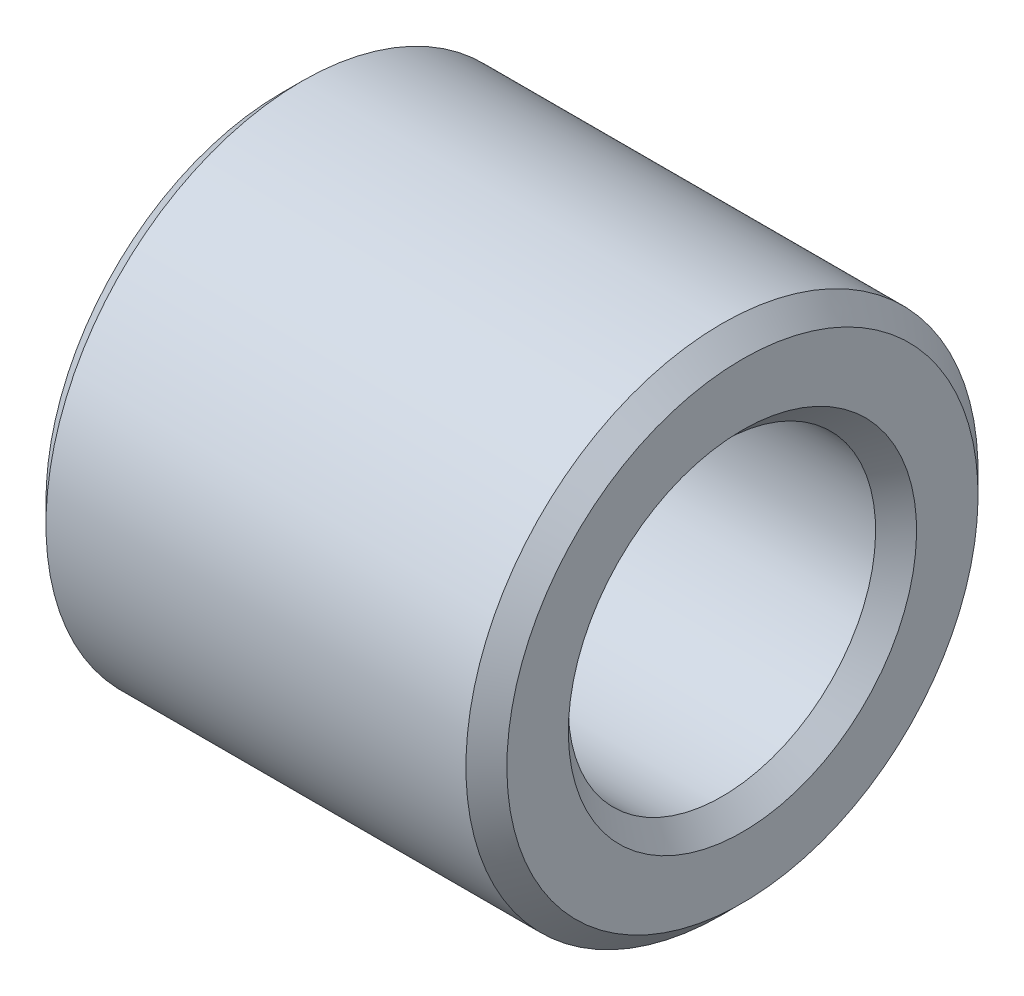
ISO-10303-21;
HEADER;
FILE_DESCRIPTION(('STEP AP214'),'2;1');
FILE_NAME('part.step','',(''),(''),'','','');
FILE_SCHEMA(('AUTOMOTIVE_DESIGN { 1 0 10303 214 1 1 1 1 }'));
ENDSEC;
DATA;
#1=APPLICATION_CONTEXT('core data for automotive mechanical design processes');
#2=APPLICATION_PROTOCOL_DEFINITION('international standard','automotive_design',2000,#1);
#3=PRODUCT_CONTEXT('',#1,'mechanical');
#4=PRODUCT('Part','Part','',(#3));
#5=PRODUCT_RELATED_PRODUCT_CATEGORY('part','',(#4));
#6=PRODUCT_DEFINITION_FORMATION('','',#4);
#7=PRODUCT_DEFINITION_CONTEXT('part definition',#1,'design');
#8=PRODUCT_DEFINITION('design','',#6,#7);
#9=PRODUCT_DEFINITION_SHAPE('','',#8);
#10=(LENGTH_UNIT() NAMED_UNIT(*) SI_UNIT(.MILLI.,.METRE.));
#11=(NAMED_UNIT(*) PLANE_ANGLE_UNIT() SI_UNIT($,.RADIAN.));
#12=(NAMED_UNIT(*) SI_UNIT($,.STERADIAN.) SOLID_ANGLE_UNIT());
#13=UNCERTAINTY_MEASURE_WITH_UNIT(LENGTH_MEASURE(1.E-05),#10,'distance_accuracy_value','');
#14=(GEOMETRIC_REPRESENTATION_CONTEXT(3) GLOBAL_UNCERTAINTY_ASSIGNED_CONTEXT((#13)) GLOBAL_UNIT_ASSIGNED_CONTEXT((#10,
#11,#12)) REPRESENTATION_CONTEXT('',''));
#15=CARTESIAN_POINT('',(0.,0.,0.));
#16=DIRECTION('',(0.,0.,1.));
#17=DIRECTION('',(1.,0.,0.));
#18=AXIS2_PLACEMENT_3D('',#15,#16,#17);
#19=CARTESIAN_POINT('',(0.2,0.,0.));
#20=DIRECTION('',(-1.,0.,0.));
#21=DIRECTION('',(0.,-1.,0.));
#22=AXIS2_PLACEMENT_3D('',#19,#20,#21);
#23=CONICAL_SURFACE('',#22,1.5,0.785398163397446);
#24=CARTESIAN_POINT('',(0.,0.,0.));
#25=DIRECTION('',(1.,0.,0.));
#26=DIRECTION('',(0.,1.,0.));
#27=AXIS2_PLACEMENT_3D('',#24,#25,#26);
#28=CIRCLE('',#27,1.7);
#29=CARTESIAN_POINT('',(0.,1.7,0.));
#30=VERTEX_POINT('',#29);
#31=EDGE_CURVE('E10',#30,#30,#28,.T.);
#32=ORIENTED_EDGE('',*,*,#31,.F.);
#33=EDGE_LOOP('',(#32));
#34=FACE_BOUND('',#33,.T.);
#35=CARTESIAN_POINT('',(0.2,0.,0.));
#36=DIRECTION('',(1.,0.,0.));
#37=DIRECTION('',(0.,1.,0.));
#38=AXIS2_PLACEMENT_3D('',#35,#36,#37);
#39=CIRCLE('',#38,1.5);
#40=CARTESIAN_POINT('',(0.2,1.5,0.));
#41=VERTEX_POINT('',#40);
#42=EDGE_CURVE('E61',#41,#41,#39,.T.);
#43=ORIENTED_EDGE('',*,*,#42,.T.);
#44=EDGE_LOOP('',(#43));
#45=FACE_BOUND('',#44,.T.);
#46=ADVANCED_FACE('F33',(#34,#45),#23,.F.);
#47=CARTESIAN_POINT('',(0.,-1.7,0.));
#48=DIRECTION('',(1.,0.,0.));
#49=DIRECTION('',(0.,1.,0.));
#50=AXIS2_PLACEMENT_3D('',#47,#48,#49);
#51=PLANE('',#50);
#52=CARTESIAN_POINT('',(0.,0.,0.));
#53=DIRECTION('',(1.,0.,0.));
#54=DIRECTION('',(0.,1.,0.));
#55=AXIS2_PLACEMENT_3D('',#52,#53,#54);
#56=CIRCLE('',#55,2.3);
#57=CARTESIAN_POINT('',(0.,2.3,0.));
#58=VERTEX_POINT('',#57);
#59=EDGE_CURVE('E39',#58,#58,#56,.T.);
#60=ORIENTED_EDGE('',*,*,#59,.F.);
#61=EDGE_LOOP('',(#60));
#62=FACE_BOUND('',#61,.T.);
#63=ORIENTED_EDGE('',*,*,#31,.T.);
#64=EDGE_LOOP('',(#63));
#65=FACE_BOUND('',#64,.T.);
#66=ADVANCED_FACE('F98',(#62,#65),#51,.F.);
#67=CARTESIAN_POINT('',(0.,0.,0.));
#68=DIRECTION('',(1.,0.,0.));
#69=DIRECTION('',(0.,1.,0.));
#70=AXIS2_PLACEMENT_3D('',#67,#68,#69);
#71=CONICAL_SURFACE('',#70,2.3,0.785398163397448);
#72=CARTESIAN_POINT('',(0.2,0.,0.));
#73=DIRECTION('',(1.,0.,0.));
#74=DIRECTION('',(0.,1.,0.));
#75=AXIS2_PLACEMENT_3D('',#72,#73,#74);
#76=CIRCLE('',#75,2.5);
#77=CARTESIAN_POINT('',(0.2,2.5,0.));
#78=VERTEX_POINT('',#77);
#79=EDGE_CURVE('E43',#78,#78,#76,.T.);
#80=ORIENTED_EDGE('',*,*,#79,.F.);
#81=EDGE_LOOP('',(#80));
#82=FACE_BOUND('',#81,.T.);
#83=ORIENTED_EDGE('',*,*,#59,.T.);
#84=EDGE_LOOP('',(#83));
#85=FACE_BOUND('',#84,.T.);
#86=ADVANCED_FACE('F93',(#82,#85),#71,.T.);
#87=CARTESIAN_POINT('',(-3.,0.,0.));
#88=DIRECTION('',(1.,0.,0.));
#89=DIRECTION('',(0.,1.,0.));
#90=AXIS2_PLACEMENT_3D('',#87,#88,#89);
#91=CYLINDRICAL_SURFACE('',#90,2.5);
#92=CARTESIAN_POINT('',(4.3,0.,0.));
#93=DIRECTION('',(1.,0.,0.));
#94=DIRECTION('',(0.,1.,0.));
#95=AXIS2_PLACEMENT_3D('',#92,#93,#94);
#96=CIRCLE('',#95,2.5);
#97=CARTESIAN_POINT('',(4.3,2.5,0.));
#98=VERTEX_POINT('',#97);
#99=EDGE_CURVE('E47',#98,#98,#96,.T.);
#100=ORIENTED_EDGE('',*,*,#99,.F.);
#101=EDGE_LOOP('',(#100));
#102=FACE_BOUND('',#101,.T.);
#103=ORIENTED_EDGE('',*,*,#79,.T.);
#104=EDGE_LOOP('',(#103));
#105=FACE_BOUND('',#104,.T.);
#106=ADVANCED_FACE('F87',(#102,#105),#91,.T.);
#107=CARTESIAN_POINT('',(4.3,0.,0.));
#108=DIRECTION('',(-1.,0.,0.));
#109=DIRECTION('',(0.,-1.,0.));
#110=AXIS2_PLACEMENT_3D('',#107,#108,#109);
#111=CONICAL_SURFACE('',#110,2.5,0.785398163397449);
#112=CARTESIAN_POINT('',(4.5,0.,0.));
#113=DIRECTION('',(1.,0.,0.));
#114=DIRECTION('',(0.,1.,0.));
#115=AXIS2_PLACEMENT_3D('',#112,#113,#114);
#116=CIRCLE('',#115,2.3);
#117=CARTESIAN_POINT('',(4.5,2.3,0.));
#118=VERTEX_POINT('',#117);
#119=EDGE_CURVE('E52',#118,#118,#116,.T.);
#120=ORIENTED_EDGE('',*,*,#119,.F.);
#121=EDGE_LOOP('',(#120));
#122=FACE_BOUND('',#121,.T.);
#123=ORIENTED_EDGE('',*,*,#99,.T.);
#124=EDGE_LOOP('',(#123));
#125=FACE_BOUND('',#124,.T.);
#126=ADVANCED_FACE('F81',(#122,#125),#111,.T.);
#127=CARTESIAN_POINT('',(4.5,-2.3,0.));
#128=DIRECTION('',(-1.,0.,0.));
#129=DIRECTION('',(0.,-1.,0.));
#130=AXIS2_PLACEMENT_3D('',#127,#128,#129);
#131=PLANE('',#130);
#132=CARTESIAN_POINT('',(4.5,0.,0.));
#133=DIRECTION('',(1.,0.,0.));
#134=DIRECTION('',(0.,1.,0.));
#135=AXIS2_PLACEMENT_3D('',#132,#133,#134);
#136=CIRCLE('',#135,1.7);
#137=CARTESIAN_POINT('',(4.5,1.7,0.));
#138=VERTEX_POINT('',#137);
#139=EDGE_CURVE('E55',#138,#138,#136,.T.);
#140=ORIENTED_EDGE('',*,*,#139,.F.);
#141=EDGE_LOOP('',(#140));
#142=FACE_BOUND('',#141,.T.);
#143=ORIENTED_EDGE('',*,*,#119,.T.);
#144=EDGE_LOOP('',(#143));
#145=FACE_BOUND('',#144,.T.);
#146=ADVANCED_FACE('F75',(#142,#145),#131,.F.);
#147=CARTESIAN_POINT('',(4.5,0.,0.));
#148=DIRECTION('',(1.,0.,0.));
#149=DIRECTION('',(0.,1.,0.));
#150=AXIS2_PLACEMENT_3D('',#147,#148,#149);
#151=CONICAL_SURFACE('',#150,1.7,0.785398163397449);
#152=CARTESIAN_POINT('',(4.3,0.,0.));
#153=DIRECTION('',(1.,0.,0.));
#154=DIRECTION('',(0.,1.,0.));
#155=AXIS2_PLACEMENT_3D('',#152,#153,#154);
#156=CIRCLE('',#155,1.5);
#157=CARTESIAN_POINT('',(4.3,1.5,0.));
#158=VERTEX_POINT('',#157);
#159=EDGE_CURVE('E58',#158,#158,#156,.T.);
#160=ORIENTED_EDGE('',*,*,#159,.F.);
#161=EDGE_LOOP('',(#160));
#162=FACE_BOUND('',#161,.T.);
#163=ORIENTED_EDGE('',*,*,#139,.T.);
#164=EDGE_LOOP('',(#163));
#165=FACE_BOUND('',#164,.T.);
#166=ADVANCED_FACE('F69',(#162,#165),#151,.F.);
#167=CARTESIAN_POINT('',(-3.,0.,0.));
#168=DIRECTION('',(1.,0.,0.));
#169=DIRECTION('',(0.,1.,0.));
#170=AXIS2_PLACEMENT_3D('',#167,#168,#169);
#171=CYLINDRICAL_SURFACE('',#170,1.5);
#172=ORIENTED_EDGE('',*,*,#42,.F.);
#173=EDGE_LOOP('',(#172));
#174=FACE_BOUND('',#173,.T.);
#175=ORIENTED_EDGE('',*,*,#159,.T.);
#176=EDGE_LOOP('',(#175));
#177=FACE_BOUND('',#176,.T.);
#178=ADVANCED_FACE('F66',(#174,#177),#171,.F.);
#179=CLOSED_SHELL('',(#46,#66,#86,#106,#126,#146,#166,#178));
#180=MANIFOLD_SOLID_BREP('B2',#179);
#181=ADVANCED_BREP_SHAPE_REPRESENTATION('',(#18,#180),#14);
#182=SHAPE_DEFINITION_REPRESENTATION(#9,#181);
ENDSEC;
END-ISO-10303-21;
